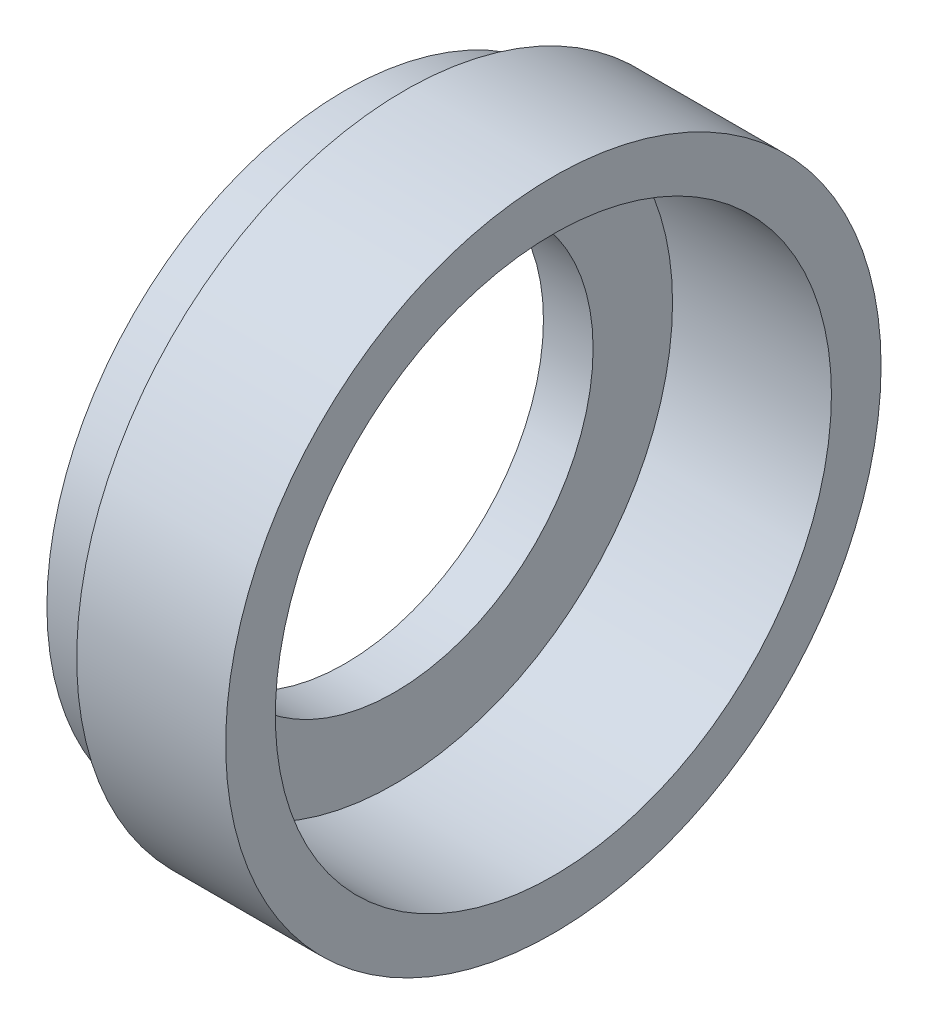
ISO-10303-21;
HEADER;
FILE_DESCRIPTION(('STEP AP214'),'2;1');
FILE_NAME('part.step','',(''),(''),'','','');
FILE_SCHEMA(('AUTOMOTIVE_DESIGN { 1 0 10303 214 1 1 1 1 }'));
ENDSEC;
DATA;
#1=APPLICATION_CONTEXT('core data for automotive mechanical design processes');
#2=APPLICATION_PROTOCOL_DEFINITION('international standard','automotive_design',2000,#1);
#3=PRODUCT_CONTEXT('',#1,'mechanical');
#4=PRODUCT('Part','Part','',(#3));
#5=PRODUCT_RELATED_PRODUCT_CATEGORY('part','',(#4));
#6=PRODUCT_DEFINITION_FORMATION('','',#4);
#7=PRODUCT_DEFINITION_CONTEXT('part definition',#1,'design');
#8=PRODUCT_DEFINITION('design','',#6,#7);
#9=PRODUCT_DEFINITION_SHAPE('','',#8);
#10=(LENGTH_UNIT() NAMED_UNIT(*) SI_UNIT(.MILLI.,.METRE.));
#11=(NAMED_UNIT(*) PLANE_ANGLE_UNIT() SI_UNIT($,.RADIAN.));
#12=(NAMED_UNIT(*) SI_UNIT($,.STERADIAN.) SOLID_ANGLE_UNIT());
#13=UNCERTAINTY_MEASURE_WITH_UNIT(LENGTH_MEASURE(1.E-05),#10,'distance_accuracy_value','');
#14=(GEOMETRIC_REPRESENTATION_CONTEXT(3) GLOBAL_UNCERTAINTY_ASSIGNED_CONTEXT((#13)) GLOBAL_UNIT_ASSIGNED_CONTEXT((#10,
#11,#12)) REPRESENTATION_CONTEXT('',''));
#15=CARTESIAN_POINT('',(0.,0.,0.));
#16=DIRECTION('',(0.,0.,1.));
#17=DIRECTION('',(1.,0.,0.));
#18=AXIS2_PLACEMENT_3D('',#15,#16,#17);
#19=CARTESIAN_POINT('',(0.,0.,0.));
#20=DIRECTION('',(1.,0.,0.));
#21=DIRECTION('',(0.,0.,-1.));
#22=AXIS2_PLACEMENT_3D('',#19,#20,#21);
#23=CYLINDRICAL_SURFACE('',#22,16.5);
#24=CARTESIAN_POINT('',(-7.50000000000001,0.,0.));
#25=DIRECTION('',(1.,0.,0.));
#26=DIRECTION('',(0.,0.,-1.));
#27=AXIS2_PLACEMENT_3D('',#24,#25,#26);
#28=CIRCLE('',#27,16.5);
#29=CARTESIAN_POINT('',(-7.50000000000001,0.,-16.5));
#30=VERTEX_POINT('',#29);
#31=EDGE_CURVE('E75',#30,#30,#28,.T.);
#32=ORIENTED_EDGE('',*,*,#31,.T.);
#33=EDGE_LOOP('',(#32));
#34=FACE_BOUND('',#33,.T.);
#35=CARTESIAN_POINT('',(0.,0.,0.));
#36=DIRECTION('',(1.,0.,0.));
#37=DIRECTION('',(0.,0.,-1.));
#38=AXIS2_PLACEMENT_3D('',#35,#36,#37);
#39=CIRCLE('',#38,16.5);
#40=CARTESIAN_POINT('',(0.,0.,-16.5));
#41=VERTEX_POINT('',#40);
#42=EDGE_CURVE('E12',#41,#41,#39,.T.);
#43=ORIENTED_EDGE('',*,*,#42,.F.);
#44=EDGE_LOOP('',(#43));
#45=FACE_BOUND('',#44,.T.);
#46=ADVANCED_FACE('F47',(#34,#45),#23,.T.);
#47=CARTESIAN_POINT('',(0.,16.5,1.66533453693773E-13));
#48=DIRECTION('',(1.,0.,0.));
#49=DIRECTION('',(0.,0.,-1.));
#50=AXIS2_PLACEMENT_3D('',#47,#48,#49);
#51=PLANE('',#50);
#52=ORIENTED_EDGE('',*,*,#42,.T.);
#53=EDGE_LOOP('',(#52));
#54=FACE_BOUND('',#53,.T.);
#55=CARTESIAN_POINT('',(0.,0.,0.));
#56=DIRECTION('',(1.,0.,0.));
#57=DIRECTION('',(0.,0.,-1.));
#58=AXIS2_PLACEMENT_3D('',#55,#56,#57);
#59=CIRCLE('',#58,14.);
#60=CARTESIAN_POINT('',(0.,0.,-14.));
#61=VERTEX_POINT('',#60);
#62=EDGE_CURVE('E53',#61,#61,#59,.T.);
#63=ORIENTED_EDGE('',*,*,#62,.F.);
#64=EDGE_LOOP('',(#63));
#65=FACE_BOUND('',#64,.T.);
#66=ADVANCED_FACE('F93',(#54,#65),#51,.T.);
#67=CARTESIAN_POINT('',(0.,0.,0.));
#68=DIRECTION('',(1.,0.,0.));
#69=DIRECTION('',(0.,0.,-1.));
#70=AXIS2_PLACEMENT_3D('',#67,#68,#69);
#71=CYLINDRICAL_SURFACE('',#70,14.);
#72=ORIENTED_EDGE('',*,*,#62,.T.);
#73=EDGE_LOOP('',(#72));
#74=FACE_BOUND('',#73,.T.);
#75=CARTESIAN_POINT('',(-8.00000000000001,0.,0.));
#76=DIRECTION('',(1.,0.,0.));
#77=DIRECTION('',(0.,0.,-1.));
#78=AXIS2_PLACEMENT_3D('',#75,#76,#77);
#79=CIRCLE('',#78,14.);
#80=CARTESIAN_POINT('',(-8.00000000000001,0.,-14.));
#81=VERTEX_POINT('',#80);
#82=EDGE_CURVE('E57',#81,#81,#79,.T.);
#83=ORIENTED_EDGE('',*,*,#82,.F.);
#84=EDGE_LOOP('',(#83));
#85=FACE_BOUND('',#84,.T.);
#86=ADVANCED_FACE('F97',(#74,#85),#71,.F.);
#87=CARTESIAN_POINT('',(-8.00000000000001,14.,0.));
#88=DIRECTION('',(1.,0.,0.));
#89=DIRECTION('',(0.,0.,-1.));
#90=AXIS2_PLACEMENT_3D('',#87,#88,#89);
#91=PLANE('',#90);
#92=ORIENTED_EDGE('',*,*,#82,.T.);
#93=EDGE_LOOP('',(#92));
#94=FACE_BOUND('',#93,.T.);
#95=CARTESIAN_POINT('',(-8.00000000000001,0.,0.));
#96=DIRECTION('',(1.,0.,0.));
#97=DIRECTION('',(0.,0.,-1.));
#98=AXIS2_PLACEMENT_3D('',#95,#96,#97);
#99=CIRCLE('',#98,10.);
#100=CARTESIAN_POINT('',(-8.00000000000001,0.,-10.));
#101=VERTEX_POINT('',#100);
#102=EDGE_CURVE('E61',#101,#101,#99,.T.);
#103=ORIENTED_EDGE('',*,*,#102,.F.);
#104=EDGE_LOOP('',(#103));
#105=FACE_BOUND('',#104,.T.);
#106=ADVANCED_FACE('F101',(#94,#105),#91,.T.);
#107=CARTESIAN_POINT('',(0.,0.,0.));
#108=DIRECTION('',(1.,0.,0.));
#109=DIRECTION('',(0.,0.,-1.));
#110=AXIS2_PLACEMENT_3D('',#107,#108,#109);
#111=CYLINDRICAL_SURFACE('',#110,10.);
#112=ORIENTED_EDGE('',*,*,#102,.T.);
#113=EDGE_LOOP('',(#112));
#114=FACE_BOUND('',#113,.T.);
#115=CARTESIAN_POINT('',(-10.5,0.,0.));
#116=DIRECTION('',(1.,0.,0.));
#117=DIRECTION('',(0.,0.,-1.));
#118=AXIS2_PLACEMENT_3D('',#115,#116,#117);
#119=CIRCLE('',#118,10.);
#120=CARTESIAN_POINT('',(-10.5,0.,-10.));
#121=VERTEX_POINT('',#120);
#122=EDGE_CURVE('E66',#121,#121,#119,.T.);
#123=ORIENTED_EDGE('',*,*,#122,.F.);
#124=EDGE_LOOP('',(#123));
#125=FACE_BOUND('',#124,.T.);
#126=ADVANCED_FACE('F107',(#114,#125),#111,.F.);
#127=CARTESIAN_POINT('',(-10.5,10.,0.));
#128=DIRECTION('',(-1.,0.,0.));
#129=DIRECTION('',(0.,0.,1.));
#130=AXIS2_PLACEMENT_3D('',#127,#128,#129);
#131=PLANE('',#130);
#132=ORIENTED_EDGE('',*,*,#122,.T.);
#133=EDGE_LOOP('',(#132));
#134=FACE_BOUND('',#133,.T.);
#135=CARTESIAN_POINT('',(-10.5,0.,0.));
#136=DIRECTION('',(1.,0.,0.));
#137=DIRECTION('',(0.,0.,-1.));
#138=AXIS2_PLACEMENT_3D('',#135,#136,#137);
#139=CIRCLE('',#138,15.);
#140=CARTESIAN_POINT('',(-10.5,0.,-15.));
#141=VERTEX_POINT('',#140);
#142=EDGE_CURVE('E69',#141,#141,#139,.T.);
#143=ORIENTED_EDGE('',*,*,#142,.F.);
#144=EDGE_LOOP('',(#143));
#145=FACE_BOUND('',#144,.T.);
#146=ADVANCED_FACE('F89',(#134,#145),#131,.T.);
#147=CARTESIAN_POINT('',(0.,0.,0.));
#148=DIRECTION('',(1.,0.,0.));
#149=DIRECTION('',(0.,0.,-1.));
#150=AXIS2_PLACEMENT_3D('',#147,#148,#149);
#151=CYLINDRICAL_SURFACE('',#150,15.);
#152=ORIENTED_EDGE('',*,*,#142,.T.);
#153=EDGE_LOOP('',(#152));
#154=FACE_BOUND('',#153,.T.);
#155=CARTESIAN_POINT('',(-7.50000000000001,0.,0.));
#156=DIRECTION('',(1.,0.,0.));
#157=DIRECTION('',(0.,0.,-1.));
#158=AXIS2_PLACEMENT_3D('',#155,#156,#157);
#159=CIRCLE('',#158,15.);
#160=CARTESIAN_POINT('',(-7.50000000000001,0.,-15.));
#161=VERTEX_POINT('',#160);
#162=EDGE_CURVE('E72',#161,#161,#159,.T.);
#163=ORIENTED_EDGE('',*,*,#162,.F.);
#164=EDGE_LOOP('',(#163));
#165=FACE_BOUND('',#164,.T.);
#166=ADVANCED_FACE('F83',(#154,#165),#151,.T.);
#167=CARTESIAN_POINT('',(-7.50000000000001,15.,0.));
#168=DIRECTION('',(-1.,0.,0.));
#169=DIRECTION('',(0.,0.,1.));
#170=AXIS2_PLACEMENT_3D('',#167,#168,#169);
#171=PLANE('',#170);
#172=ORIENTED_EDGE('',*,*,#162,.T.);
#173=EDGE_LOOP('',(#172));
#174=FACE_BOUND('',#173,.T.);
#175=ORIENTED_EDGE('',*,*,#31,.F.);
#176=EDGE_LOOP('',(#175));
#177=FACE_BOUND('',#176,.T.);
#178=ADVANCED_FACE('F81',(#174,#177),#171,.T.);
#179=CLOSED_SHELL('',(#46,#66,#86,#106,#126,#146,#166,#178));
#180=MANIFOLD_SOLID_BREP('B2',#179);
#181=ADVANCED_BREP_SHAPE_REPRESENTATION('',(#18,#180),#14);
#182=SHAPE_DEFINITION_REPRESENTATION(#9,#181);
ENDSEC;
END-ISO-10303-21;
